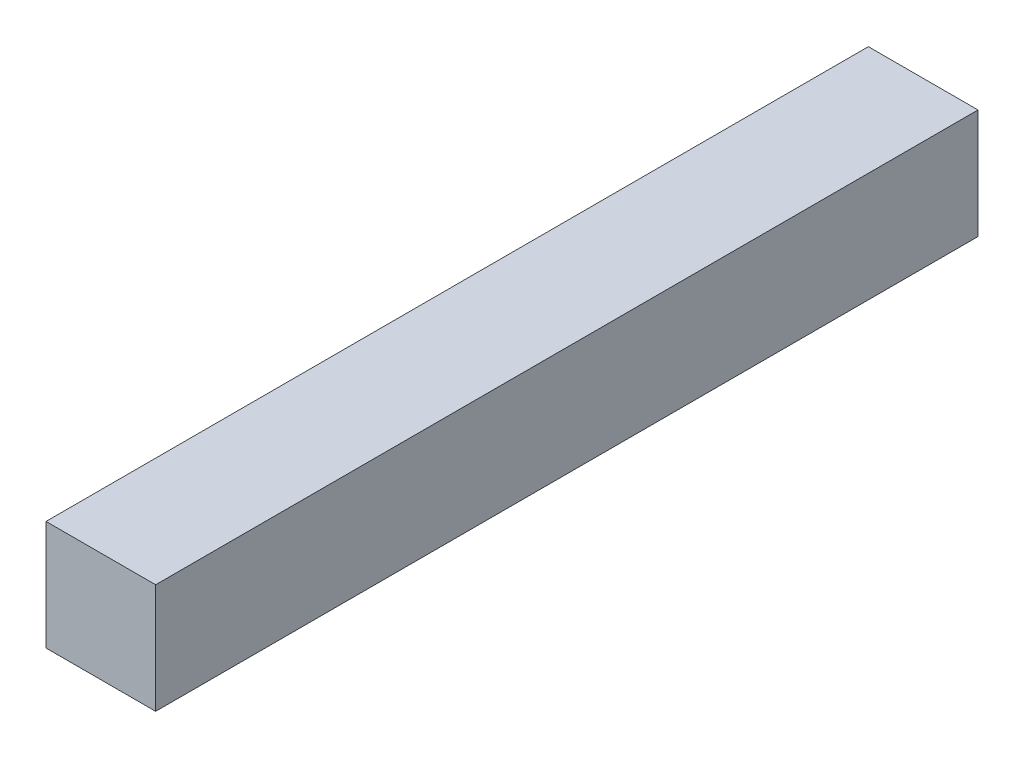
ISO-10303-21;
HEADER;
FILE_DESCRIPTION(('STEP AP214'),'2;1');
FILE_NAME('part.step','',(''),(''),'','','');
FILE_SCHEMA(('AUTOMOTIVE_DESIGN { 1 0 10303 214 1 1 1 1 }'));
ENDSEC;
DATA;
#1=APPLICATION_CONTEXT('core data for automotive mechanical design processes');
#2=APPLICATION_PROTOCOL_DEFINITION('international standard','automotive_design',2000,#1);
#3=PRODUCT_CONTEXT('',#1,'mechanical');
#4=PRODUCT('Part','Part','',(#3));
#5=PRODUCT_RELATED_PRODUCT_CATEGORY('part','',(#4));
#6=PRODUCT_DEFINITION_FORMATION('','',#4);
#7=PRODUCT_DEFINITION_CONTEXT('part definition',#1,'design');
#8=PRODUCT_DEFINITION('design','',#6,#7);
#9=PRODUCT_DEFINITION_SHAPE('','',#8);
#10=(LENGTH_UNIT() NAMED_UNIT(*) SI_UNIT(.MILLI.,.METRE.));
#11=(NAMED_UNIT(*) PLANE_ANGLE_UNIT() SI_UNIT($,.RADIAN.));
#12=(NAMED_UNIT(*) SI_UNIT($,.STERADIAN.) SOLID_ANGLE_UNIT());
#13=UNCERTAINTY_MEASURE_WITH_UNIT(LENGTH_MEASURE(1.E-05),#10,'distance_accuracy_value','');
#14=(GEOMETRIC_REPRESENTATION_CONTEXT(3) GLOBAL_UNCERTAINTY_ASSIGNED_CONTEXT((#13)) GLOBAL_UNIT_ASSIGNED_CONTEXT((#10,
#11,#12)) REPRESENTATION_CONTEXT('',''));
#15=CARTESIAN_POINT('',(0.,0.,0.));
#16=DIRECTION('',(0.,0.,1.));
#17=DIRECTION('',(1.,0.,0.));
#18=AXIS2_PLACEMENT_3D('',#15,#16,#17);
#19=CARTESIAN_POINT('',(10.16,-10.16,76.2));
#20=DIRECTION('',(-1.,0.,0.));
#21=DIRECTION('',(0.,0.,1.));
#22=AXIS2_PLACEMENT_3D('',#19,#20,#21);
#23=PLANE('',#22);
#24=DIRECTION('',(0.,1.,0.));
#25=VECTOR('',#24,1.);
#26=CARTESIAN_POINT('',(10.16,-10.16,-76.2));
#27=LINE('',#26,#25);
#28=CARTESIAN_POINT('',(10.16,-10.16,-76.2));
#29=VERTEX_POINT('',#28);
#30=CARTESIAN_POINT('',(10.16,10.16,-76.2));
#31=VERTEX_POINT('',#30);
#32=EDGE_CURVE('E104',#29,#31,#27,.T.);
#33=ORIENTED_EDGE('',*,*,#32,.T.);
#34=DIRECTION('',(0.,0.,-1.));
#35=VECTOR('',#34,1.);
#36=CARTESIAN_POINT('',(10.16,10.16,76.2));
#37=LINE('',#36,#35);
#38=CARTESIAN_POINT('',(10.16,10.16,76.2));
#39=VERTEX_POINT('',#38);
#40=EDGE_CURVE('E11',#39,#31,#37,.T.);
#41=ORIENTED_EDGE('',*,*,#40,.F.);
#42=DIRECTION('',(0.,1.,0.));
#43=VECTOR('',#42,1.);
#44=CARTESIAN_POINT('',(10.16,-10.16,76.2));
#45=LINE('',#44,#43);
#46=CARTESIAN_POINT('',(10.16,-10.16,76.2));
#47=VERTEX_POINT('',#46);
#48=EDGE_CURVE('E92',#47,#39,#45,.T.);
#49=ORIENTED_EDGE('',*,*,#48,.F.);
#50=DIRECTION('',(0.,0.,-1.));
#51=VECTOR('',#50,1.);
#52=CARTESIAN_POINT('',(10.16,-10.16,76.2));
#53=LINE('',#52,#51);
#54=EDGE_CURVE('E100',#47,#29,#53,.T.);
#55=ORIENTED_EDGE('',*,*,#54,.T.);
#56=EDGE_LOOP('',(#33,#41,#49,#55));
#57=FACE_BOUND('',#56,.T.);
#58=ADVANCED_FACE('F41',(#57),#23,.F.);
#59=CARTESIAN_POINT('',(-10.16,10.16,76.2));
#60=DIRECTION('',(0.,-1.,0.));
#61=DIRECTION('',(0.,0.,-1.));
#62=AXIS2_PLACEMENT_3D('',#59,#60,#61);
#63=PLANE('',#62);
#64=DIRECTION('',(-1.,0.,0.));
#65=VECTOR('',#64,1.);
#66=CARTESIAN_POINT('',(-10.16,10.16,-76.2));
#67=LINE('',#66,#65);
#68=CARTESIAN_POINT('',(-10.16,10.16,-76.2));
#69=VERTEX_POINT('',#68);
#70=EDGE_CURVE('E96',#31,#69,#67,.T.);
#71=ORIENTED_EDGE('',*,*,#70,.T.);
#72=DIRECTION('',(0.,0.,-1.));
#73=VECTOR('',#72,1.);
#74=CARTESIAN_POINT('',(-10.16,10.16,76.2));
#75=LINE('',#74,#73);
#76=CARTESIAN_POINT('',(-10.16,10.16,76.2));
#77=VERTEX_POINT('',#76);
#78=EDGE_CURVE('E49',#77,#69,#75,.T.);
#79=ORIENTED_EDGE('',*,*,#78,.F.);
#80=DIRECTION('',(-1.,0.,0.));
#81=VECTOR('',#80,1.);
#82=CARTESIAN_POINT('',(-10.16,10.16,76.2));
#83=LINE('',#82,#81);
#84=EDGE_CURVE('E87',#39,#77,#83,.T.);
#85=ORIENTED_EDGE('',*,*,#84,.F.);
#86=ORIENTED_EDGE('',*,*,#40,.T.);
#87=EDGE_LOOP('',(#71,#79,#85,#86));
#88=FACE_BOUND('',#87,.T.);
#89=ADVANCED_FACE('F95',(#88),#63,.F.);
#90=CARTESIAN_POINT('',(-10.16,-10.16,76.2));
#91=DIRECTION('',(1.,0.,0.));
#92=DIRECTION('',(0.,0.,-1.));
#93=AXIS2_PLACEMENT_3D('',#90,#91,#92);
#94=PLANE('',#93);
#95=DIRECTION('',(0.,-1.,0.));
#96=VECTOR('',#95,1.);
#97=CARTESIAN_POINT('',(-10.16,-10.16,-76.2));
#98=LINE('',#97,#96);
#99=CARTESIAN_POINT('',(-10.16,-10.16,-76.2));
#100=VERTEX_POINT('',#99);
#101=EDGE_CURVE('E74',#69,#100,#98,.T.);
#102=ORIENTED_EDGE('',*,*,#101,.T.);
#103=DIRECTION('',(0.,0.,-1.));
#104=VECTOR('',#103,1.);
#105=CARTESIAN_POINT('',(-10.16,-10.16,76.2));
#106=LINE('',#105,#104);
#107=CARTESIAN_POINT('',(-10.16,-10.16,76.2));
#108=VERTEX_POINT('',#107);
#109=EDGE_CURVE('E97',#108,#100,#106,.T.);
#110=ORIENTED_EDGE('',*,*,#109,.F.);
#111=DIRECTION('',(0.,-1.,0.));
#112=VECTOR('',#111,1.);
#113=CARTESIAN_POINT('',(-10.16,-10.16,76.2));
#114=LINE('',#113,#112);
#115=EDGE_CURVE('E90',#77,#108,#114,.T.);
#116=ORIENTED_EDGE('',*,*,#115,.F.);
#117=ORIENTED_EDGE('',*,*,#78,.T.);
#118=EDGE_LOOP('',(#102,#110,#116,#117));
#119=FACE_BOUND('',#118,.T.);
#120=ADVANCED_FACE('F98',(#119),#94,.F.);
#121=CARTESIAN_POINT('',(-10.16,-10.16,76.2));
#122=DIRECTION('',(0.,1.,0.));
#123=DIRECTION('',(0.,0.,1.));
#124=AXIS2_PLACEMENT_3D('',#121,#122,#123);
#125=PLANE('',#124);
#126=DIRECTION('',(1.,0.,0.));
#127=VECTOR('',#126,1.);
#128=CARTESIAN_POINT('',(-10.16,-10.16,-76.2));
#129=LINE('',#128,#127);
#130=EDGE_CURVE('E80',#100,#29,#129,.T.);
#131=ORIENTED_EDGE('',*,*,#130,.T.);
#132=ORIENTED_EDGE('',*,*,#54,.F.);
#133=DIRECTION('',(1.,0.,0.));
#134=VECTOR('',#133,1.);
#135=CARTESIAN_POINT('',(-10.16,-10.16,76.2));
#136=LINE('',#135,#134);
#137=EDGE_CURVE('E57',#108,#47,#136,.T.);
#138=ORIENTED_EDGE('',*,*,#137,.F.);
#139=ORIENTED_EDGE('',*,*,#109,.T.);
#140=EDGE_LOOP('',(#131,#132,#138,#139));
#141=FACE_BOUND('',#140,.T.);
#142=ADVANCED_FACE('F111',(#141),#125,.F.);
#143=CARTESIAN_POINT('',(0.,0.,76.2));
#144=DIRECTION('',(0.,0.,-1.));
#145=DIRECTION('',(-1.,0.,0.));
#146=AXIS2_PLACEMENT_3D('',#143,#144,#145);
#147=PLANE('',#146);
#148=ORIENTED_EDGE('',*,*,#48,.T.);
#149=ORIENTED_EDGE('',*,*,#84,.T.);
#150=ORIENTED_EDGE('',*,*,#115,.T.);
#151=ORIENTED_EDGE('',*,*,#137,.T.);
#152=EDGE_LOOP('',(#148,#149,#150,#151));
#153=FACE_BOUND('',#152,.T.);
#154=ADVANCED_FACE('F88',(#153),#147,.F.);
#155=CARTESIAN_POINT('',(0.,0.,-76.2));
#156=DIRECTION('',(0.,0.,-1.));
#157=DIRECTION('',(-1.,0.,0.));
#158=AXIS2_PLACEMENT_3D('',#155,#156,#157);
#159=PLANE('',#158);
#160=ORIENTED_EDGE('',*,*,#32,.F.);
#161=ORIENTED_EDGE('',*,*,#130,.F.);
#162=ORIENTED_EDGE('',*,*,#101,.F.);
#163=ORIENTED_EDGE('',*,*,#70,.F.);
#164=EDGE_LOOP('',(#160,#161,#162,#163));
#165=FACE_BOUND('',#164,.T.);
#166=ADVANCED_FACE('F114',(#165),#159,.T.);
#167=CLOSED_SHELL('',(#58,#89,#120,#142,#154,#166));
#168=MANIFOLD_SOLID_BREP('B2',#167);
#169=ADVANCED_BREP_SHAPE_REPRESENTATION('',(#18,#168),#14);
#170=SHAPE_DEFINITION_REPRESENTATION(#9,#169);
ENDSEC;
END-ISO-10303-21;
